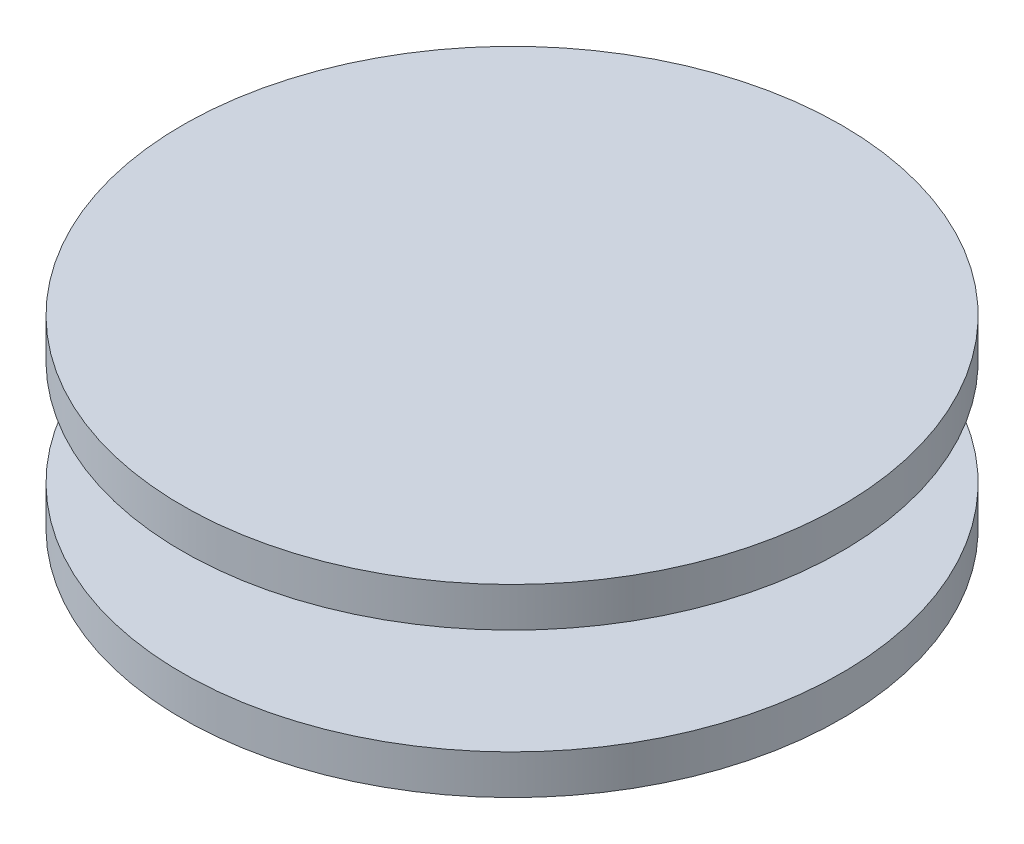
ISO-10303-21;
HEADER;
FILE_DESCRIPTION(('STEP AP214'),'2;1');
FILE_NAME('part.step','',(''),(''),'','','');
FILE_SCHEMA(('AUTOMOTIVE_DESIGN { 1 0 10303 214 1 1 1 1 }'));
ENDSEC;
DATA;
#1=APPLICATION_CONTEXT('core data for automotive mechanical design processes');
#2=APPLICATION_PROTOCOL_DEFINITION('international standard','automotive_design',2000,#1);
#3=PRODUCT_CONTEXT('',#1,'mechanical');
#4=PRODUCT('Part','Part','',(#3));
#5=PRODUCT_RELATED_PRODUCT_CATEGORY('part','',(#4));
#6=PRODUCT_DEFINITION_FORMATION('','',#4);
#7=PRODUCT_DEFINITION_CONTEXT('part definition',#1,'design');
#8=PRODUCT_DEFINITION('design','',#6,#7);
#9=PRODUCT_DEFINITION_SHAPE('','',#8);
#10=(LENGTH_UNIT() NAMED_UNIT(*) SI_UNIT(.MILLI.,.METRE.));
#11=(NAMED_UNIT(*) PLANE_ANGLE_UNIT() SI_UNIT($,.RADIAN.));
#12=(NAMED_UNIT(*) SI_UNIT($,.STERADIAN.) SOLID_ANGLE_UNIT());
#13=UNCERTAINTY_MEASURE_WITH_UNIT(LENGTH_MEASURE(1.E-05),#10,'distance_accuracy_value','');
#14=(GEOMETRIC_REPRESENTATION_CONTEXT(3) GLOBAL_UNCERTAINTY_ASSIGNED_CONTEXT((#13)) GLOBAL_UNIT_ASSIGNED_CONTEXT((#10,
#11,#12)) REPRESENTATION_CONTEXT('',''));
#15=CARTESIAN_POINT('',(0.,0.,0.));
#16=DIRECTION('',(0.,0.,1.));
#17=DIRECTION('',(1.,0.,0.));
#18=AXIS2_PLACEMENT_3D('',#15,#16,#17);
#19=CARTESIAN_POINT('',(0.,0.,0.));
#20=DIRECTION('',(0.,-1.,0.));
#21=DIRECTION('',(0.,0.,-1.));
#22=AXIS2_PLACEMENT_3D('',#19,#20,#21);
#23=PLANE('',#22);
#24=CARTESIAN_POINT('',(0.,0.,0.));
#25=DIRECTION('',(0.,-1.,0.));
#26=DIRECTION('',(0.,0.,-1.));
#27=AXIS2_PLACEMENT_3D('',#24,#25,#26);
#28=CIRCLE('',#27,25.);
#29=CARTESIAN_POINT('',(0.,0.,-25.));
#30=VERTEX_POINT('',#29);
#31=EDGE_CURVE('E10',#30,#30,#28,.T.);
#32=ORIENTED_EDGE('',*,*,#31,.T.);
#33=EDGE_LOOP('',(#32));
#34=FACE_BOUND('',#33,.T.);
#35=ADVANCED_FACE('F31',(#34),#23,.T.);
#36=CARTESIAN_POINT('',(0.,0.,0.));
#37=DIRECTION('',(0.,-1.,0.));
#38=DIRECTION('',(0.,0.,-1.));
#39=AXIS2_PLACEMENT_3D('',#36,#37,#38);
#40=CYLINDRICAL_SURFACE('',#39,25.);
#41=CARTESIAN_POINT('',(0.,3.,0.));
#42=DIRECTION('',(0.,-1.,0.));
#43=DIRECTION('',(0.,0.,-1.));
#44=AXIS2_PLACEMENT_3D('',#41,#42,#43);
#45=CIRCLE('',#44,25.);
#46=CARTESIAN_POINT('',(0.,3.,-25.));
#47=VERTEX_POINT('',#46);
#48=EDGE_CURVE('E37',#47,#47,#45,.T.);
#49=ORIENTED_EDGE('',*,*,#48,.T.);
#50=EDGE_LOOP('',(#49));
#51=FACE_BOUND('',#50,.T.);
#52=ORIENTED_EDGE('',*,*,#31,.F.);
#53=EDGE_LOOP('',(#52));
#54=FACE_BOUND('',#53,.T.);
#55=ADVANCED_FACE('F69',(#51,#54),#40,.T.);
#56=CARTESIAN_POINT('',(25.,3.,0.));
#57=DIRECTION('',(0.,1.,0.));
#58=DIRECTION('',(0.,0.,1.));
#59=AXIS2_PLACEMENT_3D('',#56,#57,#58);
#60=PLANE('',#59);
#61=CARTESIAN_POINT('',(0.,3.,0.));
#62=DIRECTION('',(0.,-1.,0.));
#63=DIRECTION('',(0.,0.,-1.));
#64=AXIS2_PLACEMENT_3D('',#61,#62,#63);
#65=CIRCLE('',#64,10.);
#66=CARTESIAN_POINT('',(0.,3.,-10.));
#67=VERTEX_POINT('',#66);
#68=EDGE_CURVE('E41',#67,#67,#65,.T.);
#69=ORIENTED_EDGE('',*,*,#68,.T.);
#70=EDGE_LOOP('',(#69));
#71=FACE_BOUND('',#70,.T.);
#72=ORIENTED_EDGE('',*,*,#48,.F.);
#73=EDGE_LOOP('',(#72));
#74=FACE_BOUND('',#73,.T.);
#75=ADVANCED_FACE('F73',(#71,#74),#60,.T.);
#76=CARTESIAN_POINT('',(0.,0.,0.));
#77=DIRECTION('',(0.,-1.,0.));
#78=DIRECTION('',(0.,0.,-1.));
#79=AXIS2_PLACEMENT_3D('',#76,#77,#78);
#80=CYLINDRICAL_SURFACE('',#79,10.);
#81=CARTESIAN_POINT('',(0.,11.,0.));
#82=DIRECTION('',(0.,-1.,0.));
#83=DIRECTION('',(0.,0.,-1.));
#84=AXIS2_PLACEMENT_3D('',#81,#82,#83);
#85=CIRCLE('',#84,10.);
#86=CARTESIAN_POINT('',(0.,11.,-10.));
#87=VERTEX_POINT('',#86);
#88=EDGE_CURVE('E45',#87,#87,#85,.T.);
#89=ORIENTED_EDGE('',*,*,#88,.T.);
#90=EDGE_LOOP('',(#89));
#91=FACE_BOUND('',#90,.T.);
#92=ORIENTED_EDGE('',*,*,#68,.F.);
#93=EDGE_LOOP('',(#92));
#94=FACE_BOUND('',#93,.T.);
#95=ADVANCED_FACE('F77',(#91,#94),#80,.T.);
#96=CARTESIAN_POINT('',(10.,11.,0.));
#97=DIRECTION('',(0.,-1.,0.));
#98=DIRECTION('',(0.,0.,-1.));
#99=AXIS2_PLACEMENT_3D('',#96,#97,#98);
#100=PLANE('',#99);
#101=CARTESIAN_POINT('',(0.,11.,0.));
#102=DIRECTION('',(0.,-1.,0.));
#103=DIRECTION('',(0.,0.,-1.));
#104=AXIS2_PLACEMENT_3D('',#101,#102,#103);
#105=CIRCLE('',#104,25.);
#106=CARTESIAN_POINT('',(0.,11.,-25.));
#107=VERTEX_POINT('',#106);
#108=EDGE_CURVE('E50',#107,#107,#105,.T.);
#109=ORIENTED_EDGE('',*,*,#108,.T.);
#110=EDGE_LOOP('',(#109));
#111=FACE_BOUND('',#110,.T.);
#112=ORIENTED_EDGE('',*,*,#88,.F.);
#113=EDGE_LOOP('',(#112));
#114=FACE_BOUND('',#113,.T.);
#115=ADVANCED_FACE('F66',(#111,#114),#100,.T.);
#116=CARTESIAN_POINT('',(0.,0.,0.));
#117=DIRECTION('',(0.,-1.,0.));
#118=DIRECTION('',(0.,0.,-1.));
#119=AXIS2_PLACEMENT_3D('',#116,#117,#118);
#120=CYLINDRICAL_SURFACE('',#119,25.);
#121=CARTESIAN_POINT('',(0.,14.,0.));
#122=DIRECTION('',(0.,-1.,0.));
#123=DIRECTION('',(0.,0.,-1.));
#124=AXIS2_PLACEMENT_3D('',#121,#122,#123);
#125=CIRCLE('',#124,25.);
#126=CARTESIAN_POINT('',(0.,14.,-25.));
#127=VERTEX_POINT('',#126);
#128=EDGE_CURVE('E53',#127,#127,#125,.T.);
#129=ORIENTED_EDGE('',*,*,#128,.T.);
#130=EDGE_LOOP('',(#129));
#131=FACE_BOUND('',#130,.T.);
#132=ORIENTED_EDGE('',*,*,#108,.F.);
#133=EDGE_LOOP('',(#132));
#134=FACE_BOUND('',#133,.T.);
#135=ADVANCED_FACE('F57',(#131,#134),#120,.T.);
#136=CARTESIAN_POINT('',(25.,14.,0.));
#137=DIRECTION('',(0.,1.,0.));
#138=DIRECTION('',(0.,0.,1.));
#139=AXIS2_PLACEMENT_3D('',#136,#137,#138);
#140=PLANE('',#139);
#141=ORIENTED_EDGE('',*,*,#128,.F.);
#142=EDGE_LOOP('',(#141));
#143=FACE_BOUND('',#142,.T.);
#144=ADVANCED_FACE('F60',(#143),#140,.T.);
#145=CLOSED_SHELL('',(#35,#55,#75,#95,#115,#135,#144));
#146=MANIFOLD_SOLID_BREP('B2',#145);
#147=ADVANCED_BREP_SHAPE_REPRESENTATION('',(#18,#146),#14);
#148=SHAPE_DEFINITION_REPRESENTATION(#9,#147);
ENDSEC;
END-ISO-10303-21;
